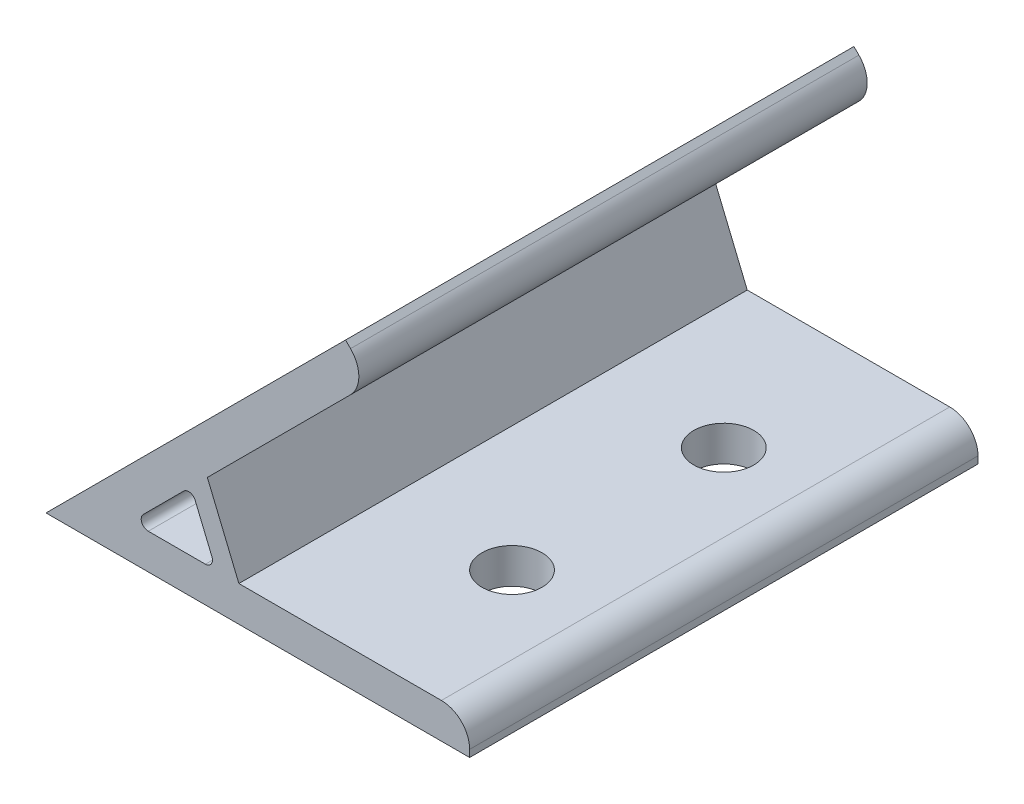
ISO-10303-21;
HEADER;
FILE_DESCRIPTION(('STEP AP214'),'2;1');
FILE_NAME('part.step','',(''),(''),'','','');
FILE_SCHEMA(('AUTOMOTIVE_DESIGN { 1 0 10303 214 1 1 1 1 }'));
ENDSEC;
DATA;
#1=APPLICATION_CONTEXT('core data for automotive mechanical design processes');
#2=APPLICATION_PROTOCOL_DEFINITION('international standard','automotive_design',2000,#1);
#3=PRODUCT_CONTEXT('',#1,'mechanical');
#4=PRODUCT('Part','Part','',(#3));
#5=PRODUCT_RELATED_PRODUCT_CATEGORY('part','',(#4));
#6=PRODUCT_DEFINITION_FORMATION('','',#4);
#7=PRODUCT_DEFINITION_CONTEXT('part definition',#1,'design');
#8=PRODUCT_DEFINITION('design','',#6,#7);
#9=PRODUCT_DEFINITION_SHAPE('','',#8);
#10=(LENGTH_UNIT() NAMED_UNIT(*) SI_UNIT(.MILLI.,.METRE.));
#11=(NAMED_UNIT(*) PLANE_ANGLE_UNIT() SI_UNIT($,.RADIAN.));
#12=(NAMED_UNIT(*) SI_UNIT($,.STERADIAN.) SOLID_ANGLE_UNIT());
#13=UNCERTAINTY_MEASURE_WITH_UNIT(LENGTH_MEASURE(1.E-05),#10,'distance_accuracy_value','');
#14=(GEOMETRIC_REPRESENTATION_CONTEXT(3) GLOBAL_UNCERTAINTY_ASSIGNED_CONTEXT((#13)) GLOBAL_UNIT_ASSIGNED_CONTEXT((#10,
#11,#12)) REPRESENTATION_CONTEXT('',''));
#15=CARTESIAN_POINT('',(0.,0.,0.));
#16=DIRECTION('',(0.,0.,1.));
#17=DIRECTION('',(1.,0.,0.));
#18=AXIS2_PLACEMENT_3D('',#15,#16,#17);
#19=CARTESIAN_POINT('',(0.,0.,36.));
#20=DIRECTION('',(0.,0.,1.));
#21=DIRECTION('',(1.,0.,0.));
#22=AXIS2_PLACEMENT_3D('',#19,#20,#21);
#23=PLANE('',#22);
#24=DIRECTION('',(0.,1.,0.));
#25=VECTOR('',#24,1.);
#26=CARTESIAN_POINT('',(60.,5.,36.));
#27=LINE('',#26,#25);
#28=CARTESIAN_POINT('',(60.,0.,36.));
#29=VERTEX_POINT('',#28);
#30=CARTESIAN_POINT('',(60.,1.,36.));
#31=VERTEX_POINT('',#30);
#32=EDGE_CURVE('E142',#29,#31,#27,.T.);
#33=ORIENTED_EDGE('',*,*,#32,.T.);
#34=CARTESIAN_POINT('',(56.,1.,36.));
#35=DIRECTION('',(0.,0.,1.));
#36=DIRECTION('',(1.,0.,0.));
#37=AXIS2_PLACEMENT_3D('',#34,#35,#36);
#38=CIRCLE('',#37,4.);
#39=CARTESIAN_POINT('',(56.,5.,36.));
#40=VERTEX_POINT('',#39);
#41=EDGE_CURVE('E184',#31,#40,#38,.T.);
#42=ORIENTED_EDGE('',*,*,#41,.T.);
#43=DIRECTION('',(-1.,0.,0.));
#44=VECTOR('',#43,1.);
#45=CARTESIAN_POINT('',(27.3182444127427,5.,36.));
#46=LINE('',#45,#44);
#47=CARTESIAN_POINT('',(27.3182444127427,5.,36.));
#48=VERTEX_POINT('',#47);
#49=EDGE_CURVE('E153',#40,#48,#46,.T.);
#50=ORIENTED_EDGE('',*,*,#49,.T.);
#51=DIRECTION('',(-0.382683432365088,0.923879532511288,0.));
#52=VECTOR('',#51,1.);
#53=CARTESIAN_POINT('',(22.8524497802947,15.781381968429,36.));
#54=LINE('',#53,#52);
#55=CARTESIAN_POINT('',(22.8524497802947,15.781381968429,36.));
#56=VERTEX_POINT('',#55);
#57=EDGE_CURVE('E244',#48,#56,#54,.T.);
#58=ORIENTED_EDGE('',*,*,#57,.T.);
#59=DIRECTION('',(0.707106781186551,0.707106781186544,0.));
#60=VECTOR('',#59,1.);
#61=CARTESIAN_POINT('',(45.9619407771258,38.8908729652599,36.));
#62=LINE('',#61,#60);
#63=CARTESIAN_POINT('',(43.1335136523796,36.0624458405137,36.));
#64=VERTEX_POINT('',#63);
#65=EDGE_CURVE('E246',#56,#64,#62,.T.);
#66=ORIENTED_EDGE('',*,*,#65,.T.);
#67=CARTESIAN_POINT('',(40.3050865276334,38.8908729652599,36.));
#68=DIRECTION('',(0.,0.,1.));
#69=DIRECTION('',(1.,0.,0.));
#70=AXIS2_PLACEMENT_3D('',#67,#68,#69);
#71=CIRCLE('',#70,4.);
#72=CARTESIAN_POINT('',(43.1335136523796,41.7193000900061,36.));
#73=VERTEX_POINT('',#72);
#74=EDGE_CURVE('E182',#64,#73,#71,.T.);
#75=ORIENTED_EDGE('',*,*,#74,.T.);
#76=DIRECTION('',(-0.707106781186544,0.707106781186551,0.));
#77=VECTOR('',#76,1.);
#78=CARTESIAN_POINT('',(42.4264068711931,42.4264068711926,36.));
#79=LINE('',#78,#77);
#80=CARTESIAN_POINT('',(42.4264068711931,42.4264068711926,36.));
#81=VERTEX_POINT('',#80);
#82=EDGE_CURVE('E249',#73,#81,#79,.T.);
#83=ORIENTED_EDGE('',*,*,#82,.T.);
#84=DIRECTION('',(-0.707106781186551,-0.707106781186544,0.));
#85=VECTOR('',#84,1.);
#86=CARTESIAN_POINT('',(0.,0.,36.));
#87=LINE('',#86,#85);
#88=CARTESIAN_POINT('',(0.,0.,36.));
#89=VERTEX_POINT('',#88);
#90=EDGE_CURVE('E158',#81,#89,#87,.T.);
#91=ORIENTED_EDGE('',*,*,#90,.T.);
#92=DIRECTION('',(1.,0.,0.));
#93=VECTOR('',#92,1.);
#94=CARTESIAN_POINT('',(60.,0.,36.));
#95=LINE('',#94,#93);
#96=EDGE_CURVE('E154',#89,#29,#95,.T.);
#97=ORIENTED_EDGE('',*,*,#96,.T.);
#98=EDGE_LOOP('',(#33,#42,#50,#58,#66,#75,#83,#91,#97));
#99=FACE_BOUND('',#98,.T.);
#100=DIRECTION('',(1.,0.,0.));
#101=VECTOR('',#100,1.);
#102=CARTESIAN_POINT('',(24.0710678118656,5.,36.));
#103=LINE('',#102,#101);
#104=CARTESIAN_POINT('',(14.4852813742387,5.,36.));
#105=VERTEX_POINT('',#104);
#106=CARTESIAN_POINT('',(22.5744620492001,5.,36.));
#107=VERTEX_POINT('',#106);
#108=EDGE_CURVE('E229',#105,#107,#103,.T.);
#109=ORIENTED_EDGE('',*,*,#108,.F.);
#110=CARTESIAN_POINT('',(14.4852813742387,6.,36.));
#111=DIRECTION('',(0.,0.,1.));
#112=DIRECTION('',(1.,0.,0.));
#113=AXIS2_PLACEMENT_3D('',#110,#111,#112);
#114=CIRCLE('',#113,1.);
#115=CARTESIAN_POINT('',(13.7781745930522,6.70710678118655,36.));
#116=VERTEX_POINT('',#115);
#117=EDGE_CURVE('E211',#105,#116,#114,.F.);
#118=ORIENTED_EDGE('',*,*,#117,.T.);
#119=DIRECTION('',(-0.707106781186549,-0.707106781186546,0.));
#120=VECTOR('',#119,1.);
#121=CARTESIAN_POINT('',(12.0710678118656,4.99999999999999,36.));
#122=LINE('',#121,#120);
#123=CARTESIAN_POINT('',(19.4980891025605,12.4270212906949,36.));
#124=VERTEX_POINT('',#123);
#125=EDGE_CURVE('E226',#124,#116,#122,.T.);
#126=ORIENTED_EDGE('',*,*,#125,.F.);
#127=CARTESIAN_POINT('',(20.2051958837471,11.7199145095083,36.));
#128=DIRECTION('',(0.,0.,1.));
#129=DIRECTION('',(1.,0.,0.));
#130=AXIS2_PLACEMENT_3D('',#127,#128,#129);
#131=CIRCLE('',#130,1.);
#132=CARTESIAN_POINT('',(21.1290754162584,12.1025979418734,36.));
#133=VERTEX_POINT('',#132);
#134=EDGE_CURVE('E207',#124,#133,#131,.F.);
#135=ORIENTED_EDGE('',*,*,#134,.T.);
#136=DIRECTION('',(-0.382683432365088,0.923879532511288,0.));
#137=VECTOR('',#136,1.);
#138=CARTESIAN_POINT('',(20.5563491861042,13.4852813742385,36.));
#139=LINE('',#138,#137);
#140=CARTESIAN_POINT('',(23.4983415817114,6.38268343236509,36.));
#141=VERTEX_POINT('',#140);
#142=EDGE_CURVE('E231',#141,#133,#139,.T.);
#143=ORIENTED_EDGE('',*,*,#142,.F.);
#144=CARTESIAN_POINT('',(22.5744620492001,6.,36.));
#145=DIRECTION('',(0.,0.,1.));
#146=DIRECTION('',(1.,0.,0.));
#147=AXIS2_PLACEMENT_3D('',#144,#145,#146);
#148=CIRCLE('',#147,1.);
#149=EDGE_CURVE('E11',#141,#107,#148,.F.);
#150=ORIENTED_EDGE('',*,*,#149,.T.);
#151=EDGE_LOOP('',(#109,#118,#126,#135,#143,#150));
#152=FACE_BOUND('',#151,.T.);
#153=ADVANCED_FACE('F35',(#99,#152),#23,.T.);
#154=CARTESIAN_POINT('',(0.,0.,-36.));
#155=DIRECTION('',(0.,0.,1.));
#156=DIRECTION('',(1.,0.,0.));
#157=AXIS2_PLACEMENT_3D('',#154,#155,#156);
#158=PLANE('',#157);
#159=DIRECTION('',(-1.,0.,0.));
#160=VECTOR('',#159,1.);
#161=CARTESIAN_POINT('',(27.3182444127427,5.,-36.));
#162=LINE('',#161,#160);
#163=CARTESIAN_POINT('',(56.,5.,-36.));
#164=VERTEX_POINT('',#163);
#165=CARTESIAN_POINT('',(27.3182444127427,5.,-36.));
#166=VERTEX_POINT('',#165);
#167=EDGE_CURVE('E256',#164,#166,#162,.T.);
#168=ORIENTED_EDGE('',*,*,#167,.F.);
#169=CARTESIAN_POINT('',(56.,1.,-36.));
#170=DIRECTION('',(0.,0.,1.));
#171=DIRECTION('',(1.,0.,0.));
#172=AXIS2_PLACEMENT_3D('',#169,#170,#171);
#173=CIRCLE('',#172,4.);
#174=CARTESIAN_POINT('',(60.,1.,-36.));
#175=VERTEX_POINT('',#174);
#176=EDGE_CURVE('E179',#164,#175,#173,.F.);
#177=ORIENTED_EDGE('',*,*,#176,.T.);
#178=DIRECTION('',(0.,1.,0.));
#179=VECTOR('',#178,1.);
#180=CARTESIAN_POINT('',(60.,5.,-36.));
#181=LINE('',#180,#179);
#182=CARTESIAN_POINT('',(60.,0.,-36.));
#183=VERTEX_POINT('',#182);
#184=EDGE_CURVE('E254',#183,#175,#181,.T.);
#185=ORIENTED_EDGE('',*,*,#184,.F.);
#186=DIRECTION('',(1.,0.,0.));
#187=VECTOR('',#186,1.);
#188=CARTESIAN_POINT('',(60.,0.,-36.));
#189=LINE('',#188,#187);
#190=CARTESIAN_POINT('',(0.,0.,-36.));
#191=VERTEX_POINT('',#190);
#192=EDGE_CURVE('E166',#191,#183,#189,.T.);
#193=ORIENTED_EDGE('',*,*,#192,.F.);
#194=DIRECTION('',(-0.707106781186551,-0.707106781186544,0.));
#195=VECTOR('',#194,1.);
#196=CARTESIAN_POINT('',(0.,0.,-36.));
#197=LINE('',#196,#195);
#198=CARTESIAN_POINT('',(42.4264068711931,42.4264068711926,-36.));
#199=VERTEX_POINT('',#198);
#200=EDGE_CURVE('E162',#199,#191,#197,.T.);
#201=ORIENTED_EDGE('',*,*,#200,.F.);
#202=DIRECTION('',(-0.707106781186544,0.707106781186551,0.));
#203=VECTOR('',#202,1.);
#204=CARTESIAN_POINT('',(42.4264068711931,42.4264068711926,-36.));
#205=LINE('',#204,#203);
#206=CARTESIAN_POINT('',(43.1335136523796,41.7193000900061,-36.));
#207=VERTEX_POINT('',#206);
#208=EDGE_CURVE('E263',#207,#199,#205,.T.);
#209=ORIENTED_EDGE('',*,*,#208,.F.);
#210=CARTESIAN_POINT('',(40.3050865276334,38.8908729652599,-36.));
#211=DIRECTION('',(0.,0.,1.));
#212=DIRECTION('',(1.,0.,0.));
#213=AXIS2_PLACEMENT_3D('',#210,#211,#212);
#214=CIRCLE('',#213,4.);
#215=CARTESIAN_POINT('',(43.1335136523796,36.0624458405137,-36.));
#216=VERTEX_POINT('',#215);
#217=EDGE_CURVE('E171',#207,#216,#214,.F.);
#218=ORIENTED_EDGE('',*,*,#217,.T.);
#219=DIRECTION('',(0.707106781186551,0.707106781186544,0.));
#220=VECTOR('',#219,1.);
#221=CARTESIAN_POINT('',(45.9619407771258,38.8908729652599,-36.));
#222=LINE('',#221,#220);
#223=CARTESIAN_POINT('',(22.8524497802947,15.781381968429,-36.));
#224=VERTEX_POINT('',#223);
#225=EDGE_CURVE('E260',#224,#216,#222,.T.);
#226=ORIENTED_EDGE('',*,*,#225,.F.);
#227=DIRECTION('',(-0.382683432365088,0.923879532511288,0.));
#228=VECTOR('',#227,1.);
#229=CARTESIAN_POINT('',(22.8524497802947,15.781381968429,-36.));
#230=LINE('',#229,#228);
#231=EDGE_CURVE('E258',#166,#224,#230,.T.);
#232=ORIENTED_EDGE('',*,*,#231,.F.);
#233=EDGE_LOOP('',(#168,#177,#185,#193,#201,#209,#218,#226,#232));
#234=FACE_BOUND('',#233,.T.);
#235=DIRECTION('',(-0.382683432365088,0.923879532511288,0.));
#236=VECTOR('',#235,1.);
#237=CARTESIAN_POINT('',(20.5563491861042,13.4852813742385,-36.));
#238=LINE('',#237,#236);
#239=CARTESIAN_POINT('',(23.4983415817114,6.38268343236509,-36.));
#240=VERTEX_POINT('',#239);
#241=CARTESIAN_POINT('',(21.1290754162584,12.1025979418734,-36.));
#242=VERTEX_POINT('',#241);
#243=EDGE_CURVE('E217',#240,#242,#238,.T.);
#244=ORIENTED_EDGE('',*,*,#243,.T.);
#245=CARTESIAN_POINT('',(20.2051958837471,11.7199145095083,-36.));
#246=DIRECTION('',(0.,0.,1.));
#247=DIRECTION('',(1.,0.,0.));
#248=AXIS2_PLACEMENT_3D('',#245,#246,#247);
#249=CIRCLE('',#248,1.);
#250=CARTESIAN_POINT('',(19.4980891025605,12.4270212906949,-36.));
#251=VERTEX_POINT('',#250);
#252=EDGE_CURVE('E205',#242,#251,#249,.T.);
#253=ORIENTED_EDGE('',*,*,#252,.T.);
#254=DIRECTION('',(-0.707106781186549,-0.707106781186546,0.));
#255=VECTOR('',#254,1.);
#256=CARTESIAN_POINT('',(12.0710678118656,4.99999999999999,-36.));
#257=LINE('',#256,#255);
#258=CARTESIAN_POINT('',(13.7781745930522,6.70710678118655,-36.));
#259=VERTEX_POINT('',#258);
#260=EDGE_CURVE('E238',#251,#259,#257,.T.);
#261=ORIENTED_EDGE('',*,*,#260,.T.);
#262=CARTESIAN_POINT('',(14.4852813742387,6.,-36.));
#263=DIRECTION('',(0.,0.,1.));
#264=DIRECTION('',(1.,0.,0.));
#265=AXIS2_PLACEMENT_3D('',#262,#263,#264);
#266=CIRCLE('',#265,1.);
#267=CARTESIAN_POINT('',(14.4852813742387,5.,-36.));
#268=VERTEX_POINT('',#267);
#269=EDGE_CURVE('E209',#259,#268,#266,.T.);
#270=ORIENTED_EDGE('',*,*,#269,.T.);
#271=DIRECTION('',(1.,0.,0.));
#272=VECTOR('',#271,1.);
#273=CARTESIAN_POINT('',(24.0710678118656,5.,-36.));
#274=LINE('',#273,#272);
#275=CARTESIAN_POINT('',(22.5744620492001,5.,-36.));
#276=VERTEX_POINT('',#275);
#277=EDGE_CURVE('E218',#268,#276,#274,.T.);
#278=ORIENTED_EDGE('',*,*,#277,.T.);
#279=CARTESIAN_POINT('',(22.5744620492001,6.,-36.));
#280=DIRECTION('',(0.,0.,1.));
#281=DIRECTION('',(1.,0.,0.));
#282=AXIS2_PLACEMENT_3D('',#279,#280,#281);
#283=CIRCLE('',#282,1.);
#284=EDGE_CURVE('E43',#276,#240,#283,.T.);
#285=ORIENTED_EDGE('',*,*,#284,.T.);
#286=EDGE_LOOP('',(#244,#253,#261,#270,#278,#285));
#287=FACE_BOUND('',#286,.T.);
#288=ADVANCED_FACE('F216',(#234,#287),#158,.F.);
#289=CARTESIAN_POINT('',(60.,0.,36.));
#290=DIRECTION('',(0.,1.,0.));
#291=DIRECTION('',(0.,0.,1.));
#292=AXIS2_PLACEMENT_3D('',#289,#290,#291);
#293=PLANE('',#292);
#294=CARTESIAN_POINT('',(45.,0.,15.));
#295=DIRECTION('',(0.,-1.,0.));
#296=DIRECTION('',(0.,0.,-1.));
#297=AXIS2_PLACEMENT_3D('',#294,#295,#296);
#298=CIRCLE('',#297,4.25);
#299=CARTESIAN_POINT('',(45.,0.,10.75));
#300=VERTEX_POINT('',#299);
#301=EDGE_CURVE('E344',#300,#300,#298,.T.);
#302=ORIENTED_EDGE('',*,*,#301,.F.);
#303=EDGE_LOOP('',(#302));
#304=FACE_BOUND('',#303,.T.);
#305=CARTESIAN_POINT('',(45.,0.,-15.));
#306=DIRECTION('',(0.,-1.,0.));
#307=DIRECTION('',(0.,0.,-1.));
#308=AXIS2_PLACEMENT_3D('',#305,#306,#307);
#309=CIRCLE('',#308,4.25000000000001);
#310=CARTESIAN_POINT('',(45.,0.,-19.25));
#311=VERTEX_POINT('',#310);
#312=EDGE_CURVE('E347',#311,#311,#309,.T.);
#313=ORIENTED_EDGE('',*,*,#312,.F.);
#314=EDGE_LOOP('',(#313));
#315=FACE_BOUND('',#314,.T.);
#316=ORIENTED_EDGE('',*,*,#192,.T.);
#317=DIRECTION('',(0.,0.,-1.));
#318=VECTOR('',#317,1.);
#319=CARTESIAN_POINT('',(60.,0.,36.));
#320=LINE('',#319,#318);
#321=EDGE_CURVE('E147',#29,#183,#320,.T.);
#322=ORIENTED_EDGE('',*,*,#321,.F.);
#323=ORIENTED_EDGE('',*,*,#96,.F.);
#324=DIRECTION('',(0.,0.,-1.));
#325=VECTOR('',#324,1.);
#326=CARTESIAN_POINT('',(0.,0.,36.));
#327=LINE('',#326,#325);
#328=EDGE_CURVE('E252',#89,#191,#327,.T.);
#329=ORIENTED_EDGE('',*,*,#328,.T.);
#330=EDGE_LOOP('',(#316,#322,#323,#329));
#331=FACE_BOUND('',#330,.T.);
#332=ADVANCED_FACE('F164',(#304,#315,#331),#293,.F.);
#333=CARTESIAN_POINT('',(60.,5.,36.));
#334=DIRECTION('',(-1.,0.,0.));
#335=DIRECTION('',(0.,0.,1.));
#336=AXIS2_PLACEMENT_3D('',#333,#334,#335);
#337=PLANE('',#336);
#338=ORIENTED_EDGE('',*,*,#184,.T.);
#339=DIRECTION('',(0.,0.,-1.));
#340=VECTOR('',#339,1.);
#341=CARTESIAN_POINT('',(60.,1.,36.));
#342=LINE('',#341,#340);
#343=EDGE_CURVE('E150',#175,#31,#342,.F.);
#344=ORIENTED_EDGE('',*,*,#343,.T.);
#345=ORIENTED_EDGE('',*,*,#32,.F.);
#346=ORIENTED_EDGE('',*,*,#321,.T.);
#347=EDGE_LOOP('',(#338,#344,#345,#346));
#348=FACE_BOUND('',#347,.T.);
#349=ADVANCED_FACE('F145',(#348),#337,.F.);
#350=CARTESIAN_POINT('',(27.3182444127427,5.,36.));
#351=DIRECTION('',(0.,-1.,0.));
#352=DIRECTION('',(0.,0.,-1.));
#353=AXIS2_PLACEMENT_3D('',#350,#351,#352);
#354=PLANE('',#353);
#355=CARTESIAN_POINT('',(45.,5.,15.));
#356=DIRECTION('',(0.,-1.,0.));
#357=DIRECTION('',(0.,0.,-1.));
#358=AXIS2_PLACEMENT_3D('',#355,#356,#357);
#359=CIRCLE('',#358,4.25);
#360=CARTESIAN_POINT('',(45.,5.,10.75));
#361=VERTEX_POINT('',#360);
#362=EDGE_CURVE('E354',#361,#361,#359,.F.);
#363=ORIENTED_EDGE('',*,*,#362,.F.);
#364=EDGE_LOOP('',(#363));
#365=FACE_BOUND('',#364,.T.);
#366=CARTESIAN_POINT('',(45.,5.,-15.));
#367=DIRECTION('',(0.,-1.,0.));
#368=DIRECTION('',(0.,0.,-1.));
#369=AXIS2_PLACEMENT_3D('',#366,#367,#368);
#370=CIRCLE('',#369,4.25000000000001);
#371=CARTESIAN_POINT('',(45.,5.,-19.25));
#372=VERTEX_POINT('',#371);
#373=EDGE_CURVE('E349',#372,#372,#370,.F.);
#374=ORIENTED_EDGE('',*,*,#373,.F.);
#375=EDGE_LOOP('',(#374));
#376=FACE_BOUND('',#375,.T.);
#377=ORIENTED_EDGE('',*,*,#49,.F.);
#378=DIRECTION('',(0.,0.,-1.));
#379=VECTOR('',#378,1.);
#380=CARTESIAN_POINT('',(56.,5.,36.));
#381=LINE('',#380,#379);
#382=EDGE_CURVE('E167',#40,#164,#381,.T.);
#383=ORIENTED_EDGE('',*,*,#382,.T.);
#384=ORIENTED_EDGE('',*,*,#167,.T.);
#385=DIRECTION('',(0.,0.,-1.));
#386=VECTOR('',#385,1.);
#387=CARTESIAN_POINT('',(27.3182444127427,5.,36.));
#388=LINE('',#387,#386);
#389=EDGE_CURVE('E168',#48,#166,#388,.T.);
#390=ORIENTED_EDGE('',*,*,#389,.F.);
#391=EDGE_LOOP('',(#377,#383,#384,#390));
#392=FACE_BOUND('',#391,.T.);
#393=ADVANCED_FACE('F295',(#365,#376,#392),#354,.F.);
#394=CARTESIAN_POINT('',(22.8524497802947,15.781381968429,36.));
#395=DIRECTION('',(-0.923879532511287,-0.382683432365088,0.));
#396=DIRECTION('',(0.382683432365088,-0.923879532511288,0.));
#397=AXIS2_PLACEMENT_3D('',#394,#395,#396);
#398=PLANE('',#397);
#399=ORIENTED_EDGE('',*,*,#231,.T.);
#400=DIRECTION('',(0.,0.,-1.));
#401=VECTOR('',#400,1.);
#402=CARTESIAN_POINT('',(22.8524497802947,15.781381968429,36.));
#403=LINE('',#402,#401);
#404=EDGE_CURVE('E174',#56,#224,#403,.T.);
#405=ORIENTED_EDGE('',*,*,#404,.F.);
#406=ORIENTED_EDGE('',*,*,#57,.F.);
#407=ORIENTED_EDGE('',*,*,#389,.T.);
#408=EDGE_LOOP('',(#399,#405,#406,#407));
#409=FACE_BOUND('',#408,.T.);
#410=ADVANCED_FACE('F293',(#409),#398,.F.);
#411=CARTESIAN_POINT('',(45.9619407771258,38.8908729652599,36.));
#412=DIRECTION('',(-0.707106781186544,0.707106781186551,0.));
#413=DIRECTION('',(-0.707106781186551,-0.707106781186544,0.));
#414=AXIS2_PLACEMENT_3D('',#411,#412,#413);
#415=PLANE('',#414);
#416=CARTESIAN_POINT('',(35.3553390593275,28.2842712474617,-20.));
#417=DIRECTION('',(-0.707106781186544,0.707106781186551,0.));
#418=DIRECTION('',(-0.707106781186551,-0.707106781186544,0.));
#419=AXIS2_PLACEMENT_3D('',#416,#417,#418);
#420=CIRCLE('',#419,4.25);
#421=CARTESIAN_POINT('',(32.3501352392847,25.2790674274189,-20.));
#422=VERTEX_POINT('',#421);
#423=EDGE_CURVE('E241',#422,#422,#420,.F.);
#424=ORIENTED_EDGE('',*,*,#423,.F.);
#425=EDGE_LOOP('',(#424));
#426=FACE_BOUND('',#425,.T.);
#427=CARTESIAN_POINT('',(35.3553390593275,28.2842712474617,20.));
#428=DIRECTION('',(-0.707106781186544,0.707106781186551,0.));
#429=DIRECTION('',(-0.707106781186551,-0.707106781186544,0.));
#430=AXIS2_PLACEMENT_3D('',#427,#428,#429);
#431=CIRCLE('',#430,4.25000000000001);
#432=CARTESIAN_POINT('',(32.3501352392847,25.2790674274189,20.));
#433=VERTEX_POINT('',#432);
#434=EDGE_CURVE('E360',#433,#433,#431,.F.);
#435=ORIENTED_EDGE('',*,*,#434,.F.);
#436=EDGE_LOOP('',(#435));
#437=FACE_BOUND('',#436,.T.);
#438=ORIENTED_EDGE('',*,*,#225,.T.);
#439=DIRECTION('',(0.,0.,-1.));
#440=VECTOR('',#439,1.);
#441=CARTESIAN_POINT('',(43.1335136523796,36.0624458405137,36.));
#442=LINE('',#441,#440);
#443=EDGE_CURVE('E189',#216,#64,#442,.F.);
#444=ORIENTED_EDGE('',*,*,#443,.T.);
#445=ORIENTED_EDGE('',*,*,#65,.F.);
#446=ORIENTED_EDGE('',*,*,#404,.T.);
#447=EDGE_LOOP('',(#438,#444,#445,#446));
#448=FACE_BOUND('',#447,.T.);
#449=ADVANCED_FACE('F274',(#426,#437,#448),#415,.F.);
#450=CARTESIAN_POINT('',(42.4264068711931,42.4264068711926,36.));
#451=DIRECTION('',(-0.707106781186551,-0.707106781186544,0.));
#452=DIRECTION('',(0.707106781186544,-0.707106781186551,0.));
#453=AXIS2_PLACEMENT_3D('',#450,#451,#452);
#454=PLANE('',#453);
#455=ORIENTED_EDGE('',*,*,#82,.F.);
#456=DIRECTION('',(0.,0.,-1.));
#457=VECTOR('',#456,1.);
#458=CARTESIAN_POINT('',(43.1335136523796,41.7193000900061,36.));
#459=LINE('',#458,#457);
#460=EDGE_CURVE('E186',#73,#207,#459,.T.);
#461=ORIENTED_EDGE('',*,*,#460,.T.);
#462=ORIENTED_EDGE('',*,*,#208,.T.);
#463=DIRECTION('',(0.,0.,-1.));
#464=VECTOR('',#463,1.);
#465=CARTESIAN_POINT('',(42.4264068711931,42.4264068711926,36.));
#466=LINE('',#465,#464);
#467=EDGE_CURVE('E267',#81,#199,#466,.T.);
#468=ORIENTED_EDGE('',*,*,#467,.F.);
#469=EDGE_LOOP('',(#455,#461,#462,#468));
#470=FACE_BOUND('',#469,.T.);
#471=ADVANCED_FACE('F289',(#470),#454,.F.);
#472=CARTESIAN_POINT('',(0.,0.,36.));
#473=DIRECTION('',(0.707106781186544,-0.707106781186551,0.));
#474=DIRECTION('',(0.707106781186551,0.707106781186544,0.));
#475=AXIS2_PLACEMENT_3D('',#472,#473,#474);
#476=PLANE('',#475);
#477=CARTESIAN_POINT('',(31.8198051533948,31.8198051533945,-20.));
#478=DIRECTION('',(-0.707106781186544,0.707106781186551,0.));
#479=DIRECTION('',(-0.707106781186551,-0.707106781186544,0.));
#480=AXIS2_PLACEMENT_3D('',#477,#478,#479);
#481=CIRCLE('',#480,4.25);
#482=CARTESIAN_POINT('',(28.814601333352,28.8146013333517,-20.));
#483=VERTEX_POINT('',#482);
#484=EDGE_CURVE('E357',#483,#483,#481,.T.);
#485=ORIENTED_EDGE('',*,*,#484,.F.);
#486=EDGE_LOOP('',(#485));
#487=FACE_BOUND('',#486,.T.);
#488=CARTESIAN_POINT('',(31.8198051533948,31.8198051533945,20.));
#489=DIRECTION('',(-0.707106781186544,0.707106781186551,0.));
#490=DIRECTION('',(-0.707106781186551,-0.707106781186544,0.));
#491=AXIS2_PLACEMENT_3D('',#488,#489,#490);
#492=CIRCLE('',#491,4.25000000000001);
#493=CARTESIAN_POINT('',(28.814601333352,28.8146013333517,20.));
#494=VERTEX_POINT('',#493);
#495=EDGE_CURVE('E363',#494,#494,#492,.T.);
#496=ORIENTED_EDGE('',*,*,#495,.F.);
#497=EDGE_LOOP('',(#496));
#498=FACE_BOUND('',#497,.T.);
#499=ORIENTED_EDGE('',*,*,#200,.T.);
#500=ORIENTED_EDGE('',*,*,#328,.F.);
#501=ORIENTED_EDGE('',*,*,#90,.F.);
#502=ORIENTED_EDGE('',*,*,#467,.T.);
#503=EDGE_LOOP('',(#499,#500,#501,#502));
#504=FACE_BOUND('',#503,.T.);
#505=ADVANCED_FACE('F322',(#487,#498,#504),#476,.F.);
#506=CARTESIAN_POINT('',(12.0710678118656,4.99999999999999,36.));
#507=DIRECTION('',(0.707106781186546,-0.707106781186549,0.));
#508=DIRECTION('',(0.707106781186549,0.707106781186546,0.));
#509=AXIS2_PLACEMENT_3D('',#506,#507,#508);
#510=PLANE('',#509);
#511=ORIENTED_EDGE('',*,*,#260,.F.);
#512=DIRECTION('',(0.,0.,-1.));
#513=VECTOR('',#512,1.);
#514=CARTESIAN_POINT('',(19.4980891025605,12.4270212906949,36.));
#515=LINE('',#514,#513);
#516=EDGE_CURVE('E199',#251,#124,#515,.F.);
#517=ORIENTED_EDGE('',*,*,#516,.T.);
#518=ORIENTED_EDGE('',*,*,#125,.T.);
#519=DIRECTION('',(0.,0.,-1.));
#520=VECTOR('',#519,1.);
#521=CARTESIAN_POINT('',(13.7781745930522,6.70710678118655,-36.));
#522=LINE('',#521,#520);
#523=EDGE_CURVE('E196',#116,#259,#522,.T.);
#524=ORIENTED_EDGE('',*,*,#523,.T.);
#525=EDGE_LOOP('',(#511,#517,#518,#524));
#526=FACE_BOUND('',#525,.T.);
#527=ADVANCED_FACE('F319',(#526),#510,.T.);
#528=CARTESIAN_POINT('',(24.0710678118656,5.,36.));
#529=DIRECTION('',(0.,1.,0.));
#530=DIRECTION('',(-1.,0.,0.));
#531=AXIS2_PLACEMENT_3D('',#528,#529,#530);
#532=PLANE('',#531);
#533=ORIENTED_EDGE('',*,*,#277,.F.);
#534=DIRECTION('',(0.,0.,-1.));
#535=VECTOR('',#534,1.);
#536=CARTESIAN_POINT('',(14.4852813742387,5.,36.));
#537=LINE('',#536,#535);
#538=EDGE_CURVE('E55',#268,#105,#537,.F.);
#539=ORIENTED_EDGE('',*,*,#538,.T.);
#540=ORIENTED_EDGE('',*,*,#108,.T.);
#541=DIRECTION('',(0.,0.,-1.));
#542=VECTOR('',#541,1.);
#543=CARTESIAN_POINT('',(22.5744620492001,5.,-36.));
#544=LINE('',#543,#542);
#545=EDGE_CURVE('E201',#107,#276,#544,.T.);
#546=ORIENTED_EDGE('',*,*,#545,.T.);
#547=EDGE_LOOP('',(#533,#539,#540,#546));
#548=FACE_BOUND('',#547,.T.);
#549=ADVANCED_FACE('F228',(#548),#532,.T.);
#550=CARTESIAN_POINT('',(20.5563491861042,13.4852813742385,36.));
#551=DIRECTION('',(-0.923879532511288,-0.382683432365088,0.));
#552=DIRECTION('',(0.382683432365088,-0.923879532511288,0.));
#553=AXIS2_PLACEMENT_3D('',#550,#551,#552);
#554=PLANE('',#553);
#555=ORIENTED_EDGE('',*,*,#142,.T.);
#556=DIRECTION('',(0.,0.,-1.));
#557=VECTOR('',#556,1.);
#558=CARTESIAN_POINT('',(21.1290754162584,12.1025979418734,-36.));
#559=LINE('',#558,#557);
#560=EDGE_CURVE('E193',#133,#242,#559,.T.);
#561=ORIENTED_EDGE('',*,*,#560,.T.);
#562=ORIENTED_EDGE('',*,*,#243,.F.);
#563=DIRECTION('',(0.,0.,-1.));
#564=VECTOR('',#563,1.);
#565=CARTESIAN_POINT('',(23.4983415817114,6.38268343236509,36.));
#566=LINE('',#565,#564);
#567=EDGE_CURVE('E191',#240,#141,#566,.F.);
#568=ORIENTED_EDGE('',*,*,#567,.T.);
#569=EDGE_LOOP('',(#555,#561,#562,#568));
#570=FACE_BOUND('',#569,.T.);
#571=ADVANCED_FACE('F224',(#570),#554,.T.);
#572=CARTESIAN_POINT('',(43.8553390593275,19.7842712474617,20.));
#573=DIRECTION('',(-0.707106781186544,0.707106781186551,0.));
#574=DIRECTION('',(-0.707106781186551,-0.707106781186544,0.));
#575=AXIS2_PLACEMENT_3D('',#572,#573,#574);
#576=CYLINDRICAL_SURFACE('',#575,4.25000000000001);
#577=ORIENTED_EDGE('',*,*,#434,.T.);
#578=EDGE_LOOP('',(#577));
#579=FACE_BOUND('',#578,.T.);
#580=ORIENTED_EDGE('',*,*,#495,.T.);
#581=EDGE_LOOP('',(#580));
#582=FACE_BOUND('',#581,.T.);
#583=ADVANCED_FACE('F368',(#579,#582),#576,.F.);
#584=CARTESIAN_POINT('',(43.8553390593275,19.7842712474617,-20.));
#585=DIRECTION('',(-0.707106781186544,0.707106781186551,0.));
#586=DIRECTION('',(-0.707106781186551,-0.707106781186544,0.));
#587=AXIS2_PLACEMENT_3D('',#584,#585,#586);
#588=CYLINDRICAL_SURFACE('',#587,4.25);
#589=ORIENTED_EDGE('',*,*,#423,.T.);
#590=EDGE_LOOP('',(#589));
#591=FACE_BOUND('',#590,.T.);
#592=ORIENTED_EDGE('',*,*,#484,.T.);
#593=EDGE_LOOP('',(#592));
#594=FACE_BOUND('',#593,.T.);
#595=ADVANCED_FACE('F372',(#591,#594),#588,.F.);
#596=CARTESIAN_POINT('',(45.,17.0208152801713,-15.));
#597=DIRECTION('',(0.,-1.,0.));
#598=DIRECTION('',(0.,0.,-1.));
#599=AXIS2_PLACEMENT_3D('',#596,#597,#598);
#600=CYLINDRICAL_SURFACE('',#599,4.25000000000001);
#601=ORIENTED_EDGE('',*,*,#373,.T.);
#602=EDGE_LOOP('',(#601));
#603=FACE_BOUND('',#602,.T.);
#604=ORIENTED_EDGE('',*,*,#312,.T.);
#605=EDGE_LOOP('',(#604));
#606=FACE_BOUND('',#605,.T.);
#607=ADVANCED_FACE('F308',(#603,#606),#600,.F.);
#608=CARTESIAN_POINT('',(45.,17.0208152801713,15.));
#609=DIRECTION('',(0.,-1.,0.));
#610=DIRECTION('',(0.,0.,-1.));
#611=AXIS2_PLACEMENT_3D('',#608,#609,#610);
#612=CYLINDRICAL_SURFACE('',#611,4.25);
#613=ORIENTED_EDGE('',*,*,#362,.T.);
#614=EDGE_LOOP('',(#613));
#615=FACE_BOUND('',#614,.T.);
#616=ORIENTED_EDGE('',*,*,#301,.T.);
#617=EDGE_LOOP('',(#616));
#618=FACE_BOUND('',#617,.T.);
#619=ADVANCED_FACE('F300',(#615,#618),#612,.F.);
#620=CARTESIAN_POINT('',(56.,1.,36.));
#621=DIRECTION('',(0.,0.,-1.));
#622=DIRECTION('',(-1.,0.,0.));
#623=AXIS2_PLACEMENT_3D('',#620,#621,#622);
#624=CYLINDRICAL_SURFACE('',#623,4.);
#625=ORIENTED_EDGE('',*,*,#41,.F.);
#626=ORIENTED_EDGE('',*,*,#343,.F.);
#627=ORIENTED_EDGE('',*,*,#176,.F.);
#628=ORIENTED_EDGE('',*,*,#382,.F.);
#629=EDGE_LOOP('',(#625,#626,#627,#628));
#630=FACE_BOUND('',#629,.T.);
#631=ADVANCED_FACE('F298',(#630),#624,.T.);
#632=CARTESIAN_POINT('',(40.3050865276334,38.8908729652599,36.));
#633=DIRECTION('',(0.,0.,-1.));
#634=DIRECTION('',(-1.,0.,0.));
#635=AXIS2_PLACEMENT_3D('',#632,#633,#634);
#636=CYLINDRICAL_SURFACE('',#635,4.);
#637=ORIENTED_EDGE('',*,*,#74,.F.);
#638=ORIENTED_EDGE('',*,*,#443,.F.);
#639=ORIENTED_EDGE('',*,*,#217,.F.);
#640=ORIENTED_EDGE('',*,*,#460,.F.);
#641=EDGE_LOOP('',(#637,#638,#639,#640));
#642=FACE_BOUND('',#641,.T.);
#643=ADVANCED_FACE('F286',(#642),#636,.T.);
#644=CARTESIAN_POINT('',(20.2051958837471,11.7199145095083,36.));
#645=DIRECTION('',(0.,0.,1.));
#646=DIRECTION('',(1.,0.,0.));
#647=AXIS2_PLACEMENT_3D('',#644,#645,#646);
#648=CYLINDRICAL_SURFACE('',#647,1.);
#649=ORIENTED_EDGE('',*,*,#134,.F.);
#650=ORIENTED_EDGE('',*,*,#516,.F.);
#651=ORIENTED_EDGE('',*,*,#252,.F.);
#652=ORIENTED_EDGE('',*,*,#560,.F.);
#653=EDGE_LOOP('',(#649,#650,#651,#652));
#654=FACE_BOUND('',#653,.T.);
#655=ADVANCED_FACE('F306',(#654),#648,.F.);
#656=CARTESIAN_POINT('',(14.4852813742387,6.,36.));
#657=DIRECTION('',(0.,0.,1.));
#658=DIRECTION('',(1.,0.,0.));
#659=AXIS2_PLACEMENT_3D('',#656,#657,#658);
#660=CYLINDRICAL_SURFACE('',#659,1.);
#661=ORIENTED_EDGE('',*,*,#117,.F.);
#662=ORIENTED_EDGE('',*,*,#538,.F.);
#663=ORIENTED_EDGE('',*,*,#269,.F.);
#664=ORIENTED_EDGE('',*,*,#523,.F.);
#665=EDGE_LOOP('',(#661,#662,#663,#664));
#666=FACE_BOUND('',#665,.T.);
#667=ADVANCED_FACE('F399',(#666),#660,.F.);
#668=CARTESIAN_POINT('',(22.5744620492001,6.,36.));
#669=DIRECTION('',(0.,0.,1.));
#670=DIRECTION('',(1.,0.,0.));
#671=AXIS2_PLACEMENT_3D('',#668,#669,#670);
#672=CYLINDRICAL_SURFACE('',#671,1.);
#673=ORIENTED_EDGE('',*,*,#149,.F.);
#674=ORIENTED_EDGE('',*,*,#567,.F.);
#675=ORIENTED_EDGE('',*,*,#284,.F.);
#676=ORIENTED_EDGE('',*,*,#545,.F.);
#677=EDGE_LOOP('',(#673,#674,#675,#676));
#678=FACE_BOUND('',#677,.T.);
#679=ADVANCED_FACE('F37',(#678),#672,.F.);
#680=CLOSED_SHELL('',(#153,#288,#332,#349,#393,#410,#449,#471,#505,#527,#549,#571,#583,#595,
#607,#619,#631,#643,#655,#667,#679));
#681=MANIFOLD_SOLID_BREP('B2',#680);
#682=ADVANCED_BREP_SHAPE_REPRESENTATION('',(#18,#681),#14);
#683=SHAPE_DEFINITION_REPRESENTATION(#9,#682);
ENDSEC;
END-ISO-10303-21;
